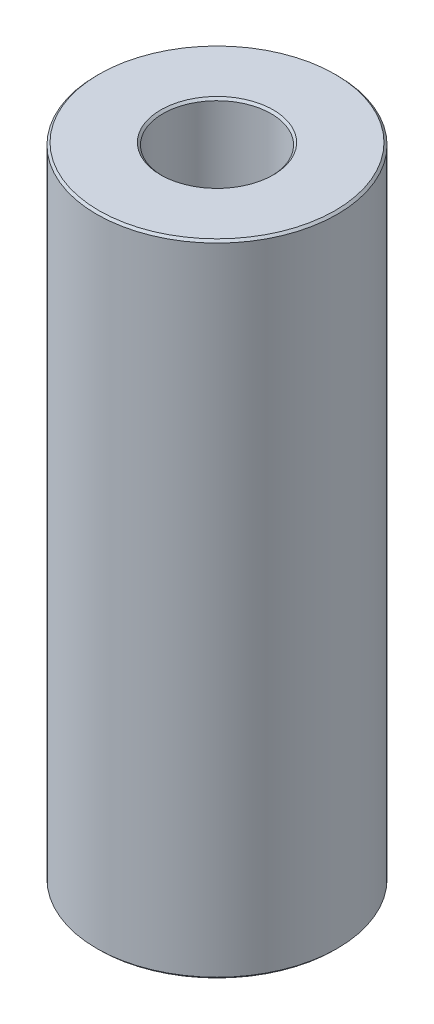
ISO-10303-21;
HEADER;
FILE_DESCRIPTION(('STEP AP214'),'2;1');
FILE_NAME('part.step','',(''),(''),'','','');
FILE_SCHEMA(('AUTOMOTIVE_DESIGN { 1 0 10303 214 1 1 1 1 }'));
ENDSEC;
DATA;
#1=APPLICATION_CONTEXT('core data for automotive mechanical design processes');
#2=APPLICATION_PROTOCOL_DEFINITION('international standard','automotive_design',2000,#1);
#3=PRODUCT_CONTEXT('',#1,'mechanical');
#4=PRODUCT('Part','Part','',(#3));
#5=PRODUCT_RELATED_PRODUCT_CATEGORY('part','',(#4));
#6=PRODUCT_DEFINITION_FORMATION('','',#4);
#7=PRODUCT_DEFINITION_CONTEXT('part definition',#1,'design');
#8=PRODUCT_DEFINITION('design','',#6,#7);
#9=PRODUCT_DEFINITION_SHAPE('','',#8);
#10=(LENGTH_UNIT() NAMED_UNIT(*) SI_UNIT(.MILLI.,.METRE.));
#11=(NAMED_UNIT(*) PLANE_ANGLE_UNIT() SI_UNIT($,.RADIAN.));
#12=(NAMED_UNIT(*) SI_UNIT($,.STERADIAN.) SOLID_ANGLE_UNIT());
#13=UNCERTAINTY_MEASURE_WITH_UNIT(LENGTH_MEASURE(1.E-05),#10,'distance_accuracy_value','');
#14=(GEOMETRIC_REPRESENTATION_CONTEXT(3) GLOBAL_UNCERTAINTY_ASSIGNED_CONTEXT((#13)) GLOBAL_UNIT_ASSIGNED_CONTEXT((#10,
#11,#12)) REPRESENTATION_CONTEXT('',''));
#15=CARTESIAN_POINT('',(0.,0.,0.));
#16=DIRECTION('',(0.,0.,1.));
#17=DIRECTION('',(1.,0.,0.));
#18=AXIS2_PLACEMENT_3D('',#15,#16,#17);
#19=CARTESIAN_POINT('',(0.,252.839723876099,0.));
#20=DIRECTION('',(0.,-1.,0.));
#21=DIRECTION('',(0.,0.,-1.));
#22=AXIS2_PLACEMENT_3D('',#19,#20,#21);
#23=CYLINDRICAL_SURFACE('',#22,47.5);
#24=CARTESIAN_POINT('',(0.,0.856978788940532,0.));
#25=DIRECTION('',(0.,1.,0.));
#26=DIRECTION('',(0.,0.,1.));
#27=AXIS2_PLACEMENT_3D('',#24,#25,#26);
#28=CIRCLE('',#27,47.5);
#29=CARTESIAN_POINT('',(0.,0.856978788940532,47.5));
#30=VERTEX_POINT('',#29);
#31=EDGE_CURVE('E10',#30,#30,#28,.T.);
#32=ORIENTED_EDGE('',*,*,#31,.T.);
#33=EDGE_LOOP('',(#32));
#34=FACE_BOUND('',#33,.T.);
#35=CARTESIAN_POINT('',(0.,251.982745087159,0.));
#36=DIRECTION('',(0.,1.,0.));
#37=DIRECTION('',(0.,0.,1.));
#38=AXIS2_PLACEMENT_3D('',#35,#36,#37);
#39=CIRCLE('',#38,47.5);
#40=CARTESIAN_POINT('',(0.,251.982745087159,47.5));
#41=VERTEX_POINT('',#40);
#42=EDGE_CURVE('E50',#41,#41,#39,.F.);
#43=ORIENTED_EDGE('',*,*,#42,.T.);
#44=EDGE_LOOP('',(#43));
#45=FACE_BOUND('',#44,.T.);
#46=ADVANCED_FACE('F39',(#34,#45),#23,.T.);
#47=CARTESIAN_POINT('',(0.,252.839723876099,0.));
#48=DIRECTION('',(0.,1.,0.));
#49=DIRECTION('',(0.,0.,1.));
#50=AXIS2_PLACEMENT_3D('',#47,#48,#49);
#51=PLANE('',#50);
#52=CARTESIAN_POINT('',(0.,252.839723876099,0.));
#53=DIRECTION('',(0.,1.,0.));
#54=DIRECTION('',(0.,0.,1.));
#55=AXIS2_PLACEMENT_3D('',#52,#53,#54);
#56=CIRCLE('',#55,22.2564788618891);
#57=CARTESIAN_POINT('',(0.,252.839723876099,22.2564788618891));
#58=VERTEX_POINT('',#57);
#59=EDGE_CURVE('E58',#58,#58,#56,.F.);
#60=ORIENTED_EDGE('',*,*,#59,.T.);
#61=EDGE_LOOP('',(#60));
#62=FACE_BOUND('',#61,.T.);
#63=CARTESIAN_POINT('',(0.,252.839723876099,0.));
#64=DIRECTION('',(0.,1.,0.));
#65=DIRECTION('',(0.,0.,1.));
#66=AXIS2_PLACEMENT_3D('',#63,#64,#65);
#67=CIRCLE('',#66,46.6430212110594);
#68=CARTESIAN_POINT('',(0.,252.839723876099,46.6430212110594));
#69=VERTEX_POINT('',#68);
#70=EDGE_CURVE('E61',#69,#69,#67,.T.);
#71=ORIENTED_EDGE('',*,*,#70,.T.);
#72=EDGE_LOOP('',(#71));
#73=FACE_BOUND('',#72,.T.);
#74=ADVANCED_FACE('F88',(#62,#73),#51,.T.);
#75=CARTESIAN_POINT('',(0.,0.,0.));
#76=DIRECTION('',(0.,1.,0.));
#77=DIRECTION('',(0.,0.,1.));
#78=AXIS2_PLACEMENT_3D('',#75,#76,#77);
#79=PLANE('',#78);
#80=CARTESIAN_POINT('',(0.,0.,0.));
#81=DIRECTION('',(0.,1.,0.));
#82=DIRECTION('',(0.,0.,1.));
#83=AXIS2_PLACEMENT_3D('',#80,#81,#82);
#84=CIRCLE('',#83,22.2564788618891);
#85=CARTESIAN_POINT('',(0.,0.,22.2564788618891));
#86=VERTEX_POINT('',#85);
#87=EDGE_CURVE('E51',#86,#86,#84,.T.);
#88=ORIENTED_EDGE('',*,*,#87,.T.);
#89=EDGE_LOOP('',(#88));
#90=FACE_BOUND('',#89,.T.);
#91=CARTESIAN_POINT('',(0.,0.,0.));
#92=DIRECTION('',(0.,1.,0.));
#93=DIRECTION('',(0.,0.,1.));
#94=AXIS2_PLACEMENT_3D('',#91,#92,#93);
#95=CIRCLE('',#94,46.6430212110595);
#96=CARTESIAN_POINT('',(0.,0.,46.6430212110595));
#97=VERTEX_POINT('',#96);
#98=EDGE_CURVE('E54',#97,#97,#95,.F.);
#99=ORIENTED_EDGE('',*,*,#98,.T.);
#100=EDGE_LOOP('',(#99));
#101=FACE_BOUND('',#100,.T.);
#102=ADVANCED_FACE('F83',(#90,#101),#79,.F.);
#103=CARTESIAN_POINT('',(0.,252.839723876099,0.));
#104=DIRECTION('',(0.,-1.,0.));
#105=DIRECTION('',(0.,0.,-1.));
#106=AXIS2_PLACEMENT_3D('',#103,#104,#105);
#107=CYLINDRICAL_SURFACE('',#106,21.3995000729486);
#108=CARTESIAN_POINT('',(0.,251.982745087159,0.));
#109=DIRECTION('',(0.,1.,0.));
#110=DIRECTION('',(0.,0.,1.));
#111=AXIS2_PLACEMENT_3D('',#108,#109,#110);
#112=CIRCLE('',#111,21.3995000729486);
#113=CARTESIAN_POINT('',(0.,251.982745087159,21.3995000729486));
#114=VERTEX_POINT('',#113);
#115=EDGE_CURVE('E67',#114,#114,#112,.T.);
#116=ORIENTED_EDGE('',*,*,#115,.T.);
#117=EDGE_LOOP('',(#116));
#118=FACE_BOUND('',#117,.T.);
#119=CARTESIAN_POINT('',(0.,0.856978788940532,0.));
#120=DIRECTION('',(0.,1.,0.));
#121=DIRECTION('',(0.,0.,1.));
#122=AXIS2_PLACEMENT_3D('',#119,#120,#121);
#123=CIRCLE('',#122,21.3995000729486);
#124=CARTESIAN_POINT('',(0.,0.856978788940532,21.3995000729486));
#125=VERTEX_POINT('',#124);
#126=EDGE_CURVE('E69',#125,#125,#123,.F.);
#127=ORIENTED_EDGE('',*,*,#126,.T.);
#128=EDGE_LOOP('',(#127));
#129=FACE_BOUND('',#128,.T.);
#130=ADVANCED_FACE('F71',(#118,#129),#107,.F.);
#131=CARTESIAN_POINT('',(0.,251.982745087159,0.));
#132=DIRECTION('',(0.,1.,0.));
#133=DIRECTION('',(0.,0.,1.));
#134=AXIS2_PLACEMENT_3D('',#131,#132,#133);
#135=CONICAL_SURFACE('',#134,21.3995000729486,0.785398163397452);
#136=ORIENTED_EDGE('',*,*,#59,.F.);
#137=EDGE_LOOP('',(#136));
#138=FACE_BOUND('',#137,.T.);
#139=ORIENTED_EDGE('',*,*,#115,.F.);
#140=EDGE_LOOP('',(#139));
#141=FACE_BOUND('',#140,.T.);
#142=ADVANCED_FACE('F77',(#138,#141),#135,.F.);
#143=CARTESIAN_POINT('',(0.,0.,0.));
#144=DIRECTION('',(0.,-1.,0.));
#145=DIRECTION('',(0.,0.,-1.));
#146=AXIS2_PLACEMENT_3D('',#143,#144,#145);
#147=CONICAL_SURFACE('',#146,22.2564788618891,0.785398163397436);
#148=ORIENTED_EDGE('',*,*,#126,.F.);
#149=EDGE_LOOP('',(#148));
#150=FACE_BOUND('',#149,.T.);
#151=ORIENTED_EDGE('',*,*,#87,.F.);
#152=EDGE_LOOP('',(#151));
#153=FACE_BOUND('',#152,.T.);
#154=ADVANCED_FACE('F73',(#150,#153),#147,.F.);
#155=CARTESIAN_POINT('',(0.,0.856978788940532,0.));
#156=DIRECTION('',(0.,1.,0.));
#157=DIRECTION('',(0.,0.,1.));
#158=AXIS2_PLACEMENT_3D('',#155,#156,#157);
#159=CONICAL_SURFACE('',#158,47.5,0.785398163397428);
#160=ORIENTED_EDGE('',*,*,#98,.F.);
#161=EDGE_LOOP('',(#160));
#162=FACE_BOUND('',#161,.T.);
#163=ORIENTED_EDGE('',*,*,#31,.F.);
#164=EDGE_LOOP('',(#163));
#165=FACE_BOUND('',#164,.T.);
#166=ADVANCED_FACE('F76',(#162,#165),#159,.T.);
#167=CARTESIAN_POINT('',(0.,252.839723876099,0.));
#168=DIRECTION('',(0.,-1.,0.));
#169=DIRECTION('',(0.,0.,-1.));
#170=AXIS2_PLACEMENT_3D('',#167,#168,#169);
#171=CONICAL_SURFACE('',#170,46.6430212110594,0.785398163397416);
#172=ORIENTED_EDGE('',*,*,#42,.F.);
#173=EDGE_LOOP('',(#172));
#174=FACE_BOUND('',#173,.T.);
#175=ORIENTED_EDGE('',*,*,#70,.F.);
#176=EDGE_LOOP('',(#175));
#177=FACE_BOUND('',#176,.T.);
#178=ADVANCED_FACE('F45',(#174,#177),#171,.T.);
#179=CLOSED_SHELL('',(#46,#74,#102,#130,#142,#154,#166,#178));
#180=MANIFOLD_SOLID_BREP('B2',#179);
#181=ADVANCED_BREP_SHAPE_REPRESENTATION('',(#18,#180),#14);
#182=SHAPE_DEFINITION_REPRESENTATION(#9,#181);
ENDSEC;
END-ISO-10303-21;
